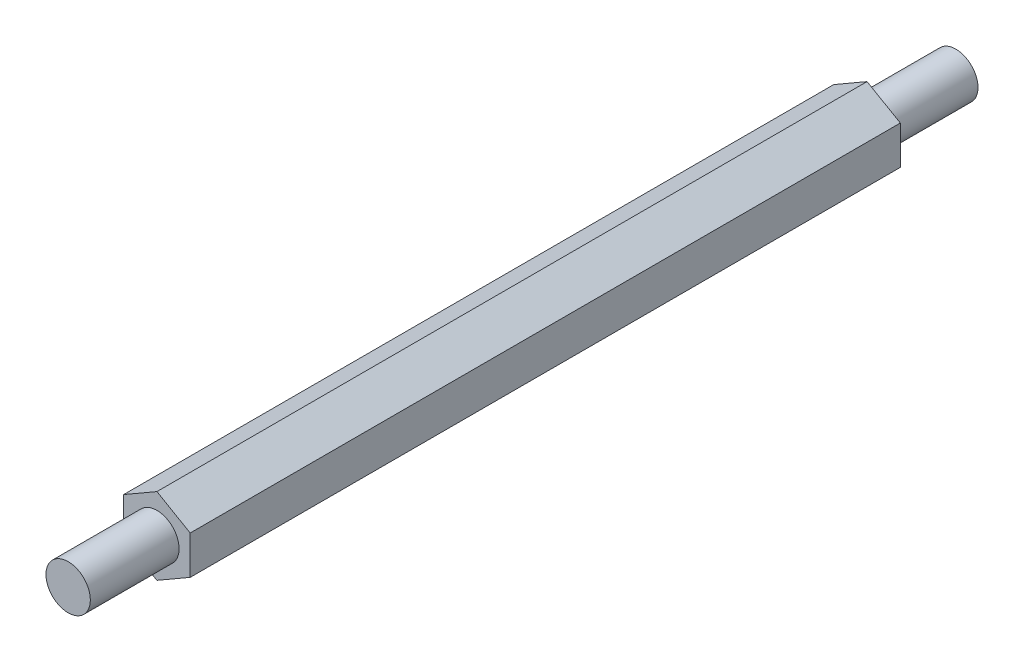
ISO-10303-21;
HEADER;
FILE_DESCRIPTION(('STEP AP214'),'2;1');
FILE_NAME('part.step','',(''),(''),'','','');
FILE_SCHEMA(('AUTOMOTIVE_DESIGN { 1 0 10303 214 1 1 1 1 }'));
ENDSEC;
DATA;
#1=APPLICATION_CONTEXT('core data for automotive mechanical design processes');
#2=APPLICATION_PROTOCOL_DEFINITION('international standard','automotive_design',2000,#1);
#3=PRODUCT_CONTEXT('',#1,'mechanical');
#4=PRODUCT('Part','Part','',(#3));
#5=PRODUCT_RELATED_PRODUCT_CATEGORY('part','',(#4));
#6=PRODUCT_DEFINITION_FORMATION('','',#4);
#7=PRODUCT_DEFINITION_CONTEXT('part definition',#1,'design');
#8=PRODUCT_DEFINITION('design','',#6,#7);
#9=PRODUCT_DEFINITION_SHAPE('','',#8);
#10=(LENGTH_UNIT() NAMED_UNIT(*) SI_UNIT(.MILLI.,.METRE.));
#11=(NAMED_UNIT(*) PLANE_ANGLE_UNIT() SI_UNIT($,.RADIAN.));
#12=(NAMED_UNIT(*) SI_UNIT($,.STERADIAN.) SOLID_ANGLE_UNIT());
#13=UNCERTAINTY_MEASURE_WITH_UNIT(LENGTH_MEASURE(1.E-05),#10,'distance_accuracy_value','');
#14=(GEOMETRIC_REPRESENTATION_CONTEXT(3) GLOBAL_UNCERTAINTY_ASSIGNED_CONTEXT((#13)) GLOBAL_UNIT_ASSIGNED_CONTEXT((#10,
#11,#12)) REPRESENTATION_CONTEXT('',''));
#15=CARTESIAN_POINT('',(0.,0.,0.));
#16=DIRECTION('',(0.,0.,1.));
#17=DIRECTION('',(1.,0.,0.));
#18=AXIS2_PLACEMENT_3D('',#15,#16,#17);
#19=CARTESIAN_POINT('',(9.52499999999995,5.4992613140313,101.6));
#20=DIRECTION('',(-0.499999999999995,-0.866025403784441,0.));
#21=DIRECTION('',(0.866025403784442,-0.499999999999995,0.));
#22=AXIS2_PLACEMENT_3D('',#19,#20,#21);
#23=PLANE('',#22);
#24=DIRECTION('',(-0.866025403784441,0.499999999999995,0.));
#25=VECTOR('',#24,1.);
#26=CARTESIAN_POINT('',(9.52499999999995,5.4992613140313,-101.6));
#27=LINE('',#26,#25);
#28=CARTESIAN_POINT('',(9.52499999999995,5.4992613140313,-101.6));
#29=VERTEX_POINT('',#28);
#30=CARTESIAN_POINT('',(0.,10.9985226280624,-101.6));
#31=VERTEX_POINT('',#30);
#32=EDGE_CURVE('E120',#29,#31,#27,.T.);
#33=ORIENTED_EDGE('',*,*,#32,.T.);
#34=DIRECTION('',(0.,0.,-1.));
#35=VECTOR('',#34,1.);
#36=CARTESIAN_POINT('',(0.,10.9985226280624,101.6));
#37=LINE('',#36,#35);
#38=CARTESIAN_POINT('',(0.,10.9985226280624,101.6));
#39=VERTEX_POINT('',#38);
#40=EDGE_CURVE('E43',#39,#31,#37,.T.);
#41=ORIENTED_EDGE('',*,*,#40,.F.);
#42=DIRECTION('',(-0.866025403784441,0.499999999999995,0.));
#43=VECTOR('',#42,1.);
#44=CARTESIAN_POINT('',(9.52499999999995,5.4992613140313,101.6));
#45=LINE('',#44,#43);
#46=CARTESIAN_POINT('',(9.52499999999995,5.4992613140313,101.6));
#47=VERTEX_POINT('',#46);
#48=EDGE_CURVE('E131',#47,#39,#45,.T.);
#49=ORIENTED_EDGE('',*,*,#48,.F.);
#50=DIRECTION('',(0.,0.,-1.));
#51=VECTOR('',#50,1.);
#52=CARTESIAN_POINT('',(9.52499999999995,5.4992613140313,101.6));
#53=LINE('',#52,#51);
#54=EDGE_CURVE('E116',#47,#29,#53,.T.);
#55=ORIENTED_EDGE('',*,*,#54,.T.);
#56=EDGE_LOOP('',(#33,#41,#49,#55));
#57=FACE_BOUND('',#56,.T.);
#58=ADVANCED_FACE('F35',(#57),#23,.F.);
#59=CARTESIAN_POINT('',(0.,10.9985226280624,101.6));
#60=DIRECTION('',(0.500000000000001,-0.866025403784438,0.));
#61=DIRECTION('',(0.866025403784438,0.500000000000001,0.));
#62=AXIS2_PLACEMENT_3D('',#59,#60,#61);
#63=PLANE('',#62);
#64=DIRECTION('',(-0.866025403784438,-0.500000000000001,0.));
#65=VECTOR('',#64,1.);
#66=CARTESIAN_POINT('',(0.,10.9985226280624,-101.6));
#67=LINE('',#66,#65);
#68=CARTESIAN_POINT('',(-9.52500000000002,5.49926131403117,-101.6));
#69=VERTEX_POINT('',#68);
#70=EDGE_CURVE('E123',#31,#69,#67,.T.);
#71=ORIENTED_EDGE('',*,*,#70,.T.);
#72=DIRECTION('',(0.,0.,-1.));
#73=VECTOR('',#72,1.);
#74=CARTESIAN_POINT('',(-9.52500000000002,5.49926131403117,101.6));
#75=LINE('',#74,#73);
#76=CARTESIAN_POINT('',(-9.52500000000002,5.49926131403117,101.6));
#77=VERTEX_POINT('',#76);
#78=EDGE_CURVE('E135',#77,#69,#75,.T.);
#79=ORIENTED_EDGE('',*,*,#78,.F.);
#80=DIRECTION('',(-0.866025403784438,-0.500000000000001,0.));
#81=VECTOR('',#80,1.);
#82=CARTESIAN_POINT('',(0.,10.9985226280624,101.6));
#83=LINE('',#82,#81);
#84=EDGE_CURVE('E89',#39,#77,#83,.T.);
#85=ORIENTED_EDGE('',*,*,#84,.F.);
#86=ORIENTED_EDGE('',*,*,#40,.T.);
#87=EDGE_LOOP('',(#71,#79,#85,#86));
#88=FACE_BOUND('',#87,.T.);
#89=ADVANCED_FACE('F138',(#88),#63,.F.);
#90=CARTESIAN_POINT('',(-9.52500000000002,5.49926131403117,101.6));
#91=DIRECTION('',(1.,0.,0.));
#92=DIRECTION('',(0.,1.,0.));
#93=AXIS2_PLACEMENT_3D('',#90,#91,#92);
#94=PLANE('',#93);
#95=DIRECTION('',(0.,-1.,0.));
#96=VECTOR('',#95,1.);
#97=CARTESIAN_POINT('',(-9.52500000000002,5.49926131403117,-101.6));
#98=LINE('',#97,#96);
#99=CARTESIAN_POINT('',(-9.52499999999998,-5.49926131403123,-101.6));
#100=VERTEX_POINT('',#99);
#101=EDGE_CURVE('E126',#69,#100,#98,.T.);
#102=ORIENTED_EDGE('',*,*,#101,.T.);
#103=DIRECTION('',(0.,0.,-1.));
#104=VECTOR('',#103,1.);
#105=CARTESIAN_POINT('',(-9.52499999999998,-5.49926131403123,101.6));
#106=LINE('',#105,#104);
#107=CARTESIAN_POINT('',(-9.52499999999998,-5.49926131403123,101.6));
#108=VERTEX_POINT('',#107);
#109=EDGE_CURVE('E111',#108,#100,#106,.T.);
#110=ORIENTED_EDGE('',*,*,#109,.F.);
#111=DIRECTION('',(0.,-1.,0.));
#112=VECTOR('',#111,1.);
#113=CARTESIAN_POINT('',(-9.52500000000002,5.49926131403117,101.6));
#114=LINE('',#113,#112);
#115=EDGE_CURVE('E102',#77,#108,#114,.T.);
#116=ORIENTED_EDGE('',*,*,#115,.F.);
#117=ORIENTED_EDGE('',*,*,#78,.T.);
#118=EDGE_LOOP('',(#102,#110,#116,#117));
#119=FACE_BOUND('',#118,.T.);
#120=ADVANCED_FACE('F146',(#119),#94,.F.);
#121=CARTESIAN_POINT('',(-9.52499999999998,-5.49926131403123,101.6));
#122=DIRECTION('',(0.499999999999995,0.866025403784441,0.));
#123=DIRECTION('',(-0.866025403784441,0.499999999999995,0.));
#124=AXIS2_PLACEMENT_3D('',#121,#122,#123);
#125=PLANE('',#124);
#126=DIRECTION('',(0.866025403784441,-0.499999999999995,0.));
#127=VECTOR('',#126,1.);
#128=CARTESIAN_POINT('',(-9.52499999999998,-5.49926131403123,-101.6));
#129=LINE('',#128,#127);
#130=CARTESIAN_POINT('',(0.,-10.9985226280624,-101.6));
#131=VERTEX_POINT('',#130);
#132=EDGE_CURVE('E110',#100,#131,#129,.T.);
#133=ORIENTED_EDGE('',*,*,#132,.T.);
#134=DIRECTION('',(0.,0.,-1.));
#135=VECTOR('',#134,1.);
#136=CARTESIAN_POINT('',(0.,-10.9985226280624,101.6));
#137=LINE('',#136,#135);
#138=CARTESIAN_POINT('',(0.,-10.9985226280624,101.6));
#139=VERTEX_POINT('',#138);
#140=EDGE_CURVE('E107',#139,#131,#137,.T.);
#141=ORIENTED_EDGE('',*,*,#140,.F.);
#142=DIRECTION('',(0.866025403784441,-0.499999999999995,0.));
#143=VECTOR('',#142,1.);
#144=CARTESIAN_POINT('',(-9.52499999999998,-5.49926131403123,101.6));
#145=LINE('',#144,#143);
#146=EDGE_CURVE('E96',#108,#139,#145,.T.);
#147=ORIENTED_EDGE('',*,*,#146,.F.);
#148=ORIENTED_EDGE('',*,*,#109,.T.);
#149=EDGE_LOOP('',(#133,#141,#147,#148));
#150=FACE_BOUND('',#149,.T.);
#151=ADVANCED_FACE('F108',(#150),#125,.F.);
#152=CARTESIAN_POINT('',(0.,-10.9985226280624,101.6));
#153=DIRECTION('',(-0.500000000000007,0.866025403784434,0.));
#154=DIRECTION('',(-0.866025403784435,-0.500000000000007,0.));
#155=AXIS2_PLACEMENT_3D('',#152,#153,#154);
#156=PLANE('',#155);
#157=DIRECTION('',(0.866025403784434,0.500000000000007,0.));
#158=VECTOR('',#157,1.);
#159=CARTESIAN_POINT('',(0.,-10.9985226280624,-101.6));
#160=LINE('',#159,#158);
#161=CARTESIAN_POINT('',(9.52500000000006,-5.4992613140311,-101.6));
#162=VERTEX_POINT('',#161);
#163=EDGE_CURVE('E74',#131,#162,#160,.T.);
#164=ORIENTED_EDGE('',*,*,#163,.T.);
#165=DIRECTION('',(0.,0.,-1.));
#166=VECTOR('',#165,1.);
#167=CARTESIAN_POINT('',(9.52500000000006,-5.4992613140311,101.6));
#168=LINE('',#167,#166);
#169=CARTESIAN_POINT('',(9.52500000000006,-5.4992613140311,101.6));
#170=VERTEX_POINT('',#169);
#171=EDGE_CURVE('E112',#170,#162,#168,.T.);
#172=ORIENTED_EDGE('',*,*,#171,.F.);
#173=DIRECTION('',(0.866025403784434,0.500000000000007,0.));
#174=VECTOR('',#173,1.);
#175=CARTESIAN_POINT('',(0.,-10.9985226280624,101.6));
#176=LINE('',#175,#174);
#177=EDGE_CURVE('E100',#139,#170,#176,.T.);
#178=ORIENTED_EDGE('',*,*,#177,.F.);
#179=ORIENTED_EDGE('',*,*,#140,.T.);
#180=EDGE_LOOP('',(#164,#172,#178,#179));
#181=FACE_BOUND('',#180,.T.);
#182=ADVANCED_FACE('F114',(#181),#156,.F.);
#183=CARTESIAN_POINT('',(9.52500000000006,-5.4992613140311,101.6));
#184=DIRECTION('',(-1.,0.,0.));
#185=DIRECTION('',(0.,-1.,0.));
#186=AXIS2_PLACEMENT_3D('',#183,#184,#185);
#187=PLANE('',#186);
#188=DIRECTION('',(0.,1.,0.));
#189=VECTOR('',#188,1.);
#190=CARTESIAN_POINT('',(9.52500000000006,-5.4992613140311,-101.6));
#191=LINE('',#190,#189);
#192=EDGE_CURVE('E80',#162,#29,#191,.T.);
#193=ORIENTED_EDGE('',*,*,#192,.T.);
#194=ORIENTED_EDGE('',*,*,#54,.F.);
#195=DIRECTION('',(0.,1.,0.));
#196=VECTOR('',#195,1.);
#197=CARTESIAN_POINT('',(9.52500000000006,-5.4992613140311,101.6));
#198=LINE('',#197,#196);
#199=EDGE_CURVE('E51',#170,#47,#198,.T.);
#200=ORIENTED_EDGE('',*,*,#199,.F.);
#201=ORIENTED_EDGE('',*,*,#171,.T.);
#202=EDGE_LOOP('',(#193,#194,#200,#201));
#203=FACE_BOUND('',#202,.T.);
#204=ADVANCED_FACE('F175',(#203),#187,.F.);
#205=CARTESIAN_POINT('',(0.,0.,101.6));
#206=DIRECTION('',(0.,0.,1.));
#207=DIRECTION('',(1.,0.,0.));
#208=AXIS2_PLACEMENT_3D('',#205,#206,#207);
#209=PLANE('',#208);
#210=CARTESIAN_POINT('',(0.,0.,101.6));
#211=DIRECTION('',(0.,0.,1.));
#212=DIRECTION('',(1.,0.,0.));
#213=AXIS2_PLACEMENT_3D('',#210,#211,#212);
#214=CIRCLE('',#213,6.35);
#215=CARTESIAN_POINT('',(6.35,0.,101.6));
#216=VERTEX_POINT('',#215);
#217=EDGE_CURVE('E124',#216,#216,#214,.F.);
#218=ORIENTED_EDGE('',*,*,#217,.T.);
#219=EDGE_LOOP('',(#218));
#220=FACE_BOUND('',#219,.T.);
#221=ORIENTED_EDGE('',*,*,#48,.T.);
#222=ORIENTED_EDGE('',*,*,#84,.T.);
#223=ORIENTED_EDGE('',*,*,#115,.T.);
#224=ORIENTED_EDGE('',*,*,#146,.T.);
#225=ORIENTED_EDGE('',*,*,#177,.T.);
#226=ORIENTED_EDGE('',*,*,#199,.T.);
#227=EDGE_LOOP('',(#221,#222,#223,#224,#225,#226));
#228=FACE_BOUND('',#227,.T.);
#229=ADVANCED_FACE('F98',(#220,#228),#209,.T.);
#230=CARTESIAN_POINT('',(0.,0.,-101.6));
#231=DIRECTION('',(0.,0.,1.));
#232=DIRECTION('',(1.,0.,0.));
#233=AXIS2_PLACEMENT_3D('',#230,#231,#232);
#234=PLANE('',#233);
#235=CARTESIAN_POINT('',(0.,0.,-101.6));
#236=DIRECTION('',(0.,0.,1.));
#237=DIRECTION('',(1.,0.,0.));
#238=AXIS2_PLACEMENT_3D('',#235,#236,#237);
#239=CIRCLE('',#238,6.35);
#240=CARTESIAN_POINT('',(6.35,0.,-101.6));
#241=VERTEX_POINT('',#240);
#242=EDGE_CURVE('E12',#241,#241,#239,.F.);
#243=ORIENTED_EDGE('',*,*,#242,.F.);
#244=EDGE_LOOP('',(#243));
#245=FACE_BOUND('',#244,.T.);
#246=ORIENTED_EDGE('',*,*,#32,.F.);
#247=ORIENTED_EDGE('',*,*,#192,.F.);
#248=ORIENTED_EDGE('',*,*,#163,.F.);
#249=ORIENTED_EDGE('',*,*,#132,.F.);
#250=ORIENTED_EDGE('',*,*,#101,.F.);
#251=ORIENTED_EDGE('',*,*,#70,.F.);
#252=EDGE_LOOP('',(#246,#247,#248,#249,#250,#251));
#253=FACE_BOUND('',#252,.T.);
#254=ADVANCED_FACE('F143',(#245,#253),#234,.F.);
#255=CARTESIAN_POINT('',(0.,0.,-127.));
#256=DIRECTION('',(0.,0.,1.));
#257=DIRECTION('',(1.,0.,0.));
#258=AXIS2_PLACEMENT_3D('',#255,#256,#257);
#259=PLANE('',#258);
#260=CARTESIAN_POINT('',(0.,0.,-127.));
#261=DIRECTION('',(0.,0.,1.));
#262=DIRECTION('',(1.,0.,0.));
#263=AXIS2_PLACEMENT_3D('',#260,#261,#262);
#264=CIRCLE('',#263,6.35);
#265=CARTESIAN_POINT('',(6.35,0.,-127.));
#266=VERTEX_POINT('',#265);
#267=EDGE_CURVE('E155',#266,#266,#264,.F.);
#268=ORIENTED_EDGE('',*,*,#267,.T.);
#269=EDGE_LOOP('',(#268));
#270=FACE_BOUND('',#269,.T.);
#271=ADVANCED_FACE('F159',(#270),#259,.F.);
#272=CARTESIAN_POINT('',(0.,0.,170.360512242138));
#273=DIRECTION('',(0.,0.,-1.));
#274=DIRECTION('',(-1.,0.,0.));
#275=AXIS2_PLACEMENT_3D('',#272,#273,#274);
#276=CYLINDRICAL_SURFACE('',#275,6.35);
#277=ORIENTED_EDGE('',*,*,#267,.F.);
#278=EDGE_LOOP('',(#277));
#279=FACE_BOUND('',#278,.T.);
#280=ORIENTED_EDGE('',*,*,#242,.T.);
#281=EDGE_LOOP('',(#280));
#282=FACE_BOUND('',#281,.T.);
#283=ADVANCED_FACE('F161',(#279,#282),#276,.T.);
#284=ORIENTED_EDGE('',*,*,#217,.F.);
#285=EDGE_LOOP('',(#284));
#286=FACE_BOUND('',#285,.T.);
#287=CARTESIAN_POINT('',(0.,0.,127.));
#288=DIRECTION('',(0.,0.,1.));
#289=DIRECTION('',(1.,0.,0.));
#290=AXIS2_PLACEMENT_3D('',#287,#288,#289);
#291=CIRCLE('',#290,6.35);
#292=CARTESIAN_POINT('',(6.35,0.,127.));
#293=VERTEX_POINT('',#292);
#294=EDGE_CURVE('E152',#293,#293,#291,.T.);
#295=ORIENTED_EDGE('',*,*,#294,.F.);
#296=EDGE_LOOP('',(#295));
#297=FACE_BOUND('',#296,.T.);
#298=ADVANCED_FACE('F164',(#286,#297),#276,.T.);
#299=CARTESIAN_POINT('',(0.,0.,127.));
#300=DIRECTION('',(0.,0.,1.));
#301=DIRECTION('',(1.,0.,0.));
#302=AXIS2_PLACEMENT_3D('',#299,#300,#301);
#303=PLANE('',#302);
#304=ORIENTED_EDGE('',*,*,#294,.T.);
#305=EDGE_LOOP('',(#304));
#306=FACE_BOUND('',#305,.T.);
#307=ADVANCED_FACE('F225',(#306),#303,.T.);
#308=CLOSED_SHELL('',(#58,#89,#120,#151,#182,#204,#229,#254,#271,#283,#298,#307));
#309=MANIFOLD_SOLID_BREP('B2',#308);
#310=ADVANCED_BREP_SHAPE_REPRESENTATION('',(#18,#309),#14);
#311=SHAPE_DEFINITION_REPRESENTATION(#9,#310);
ENDSEC;
END-ISO-10303-21;
